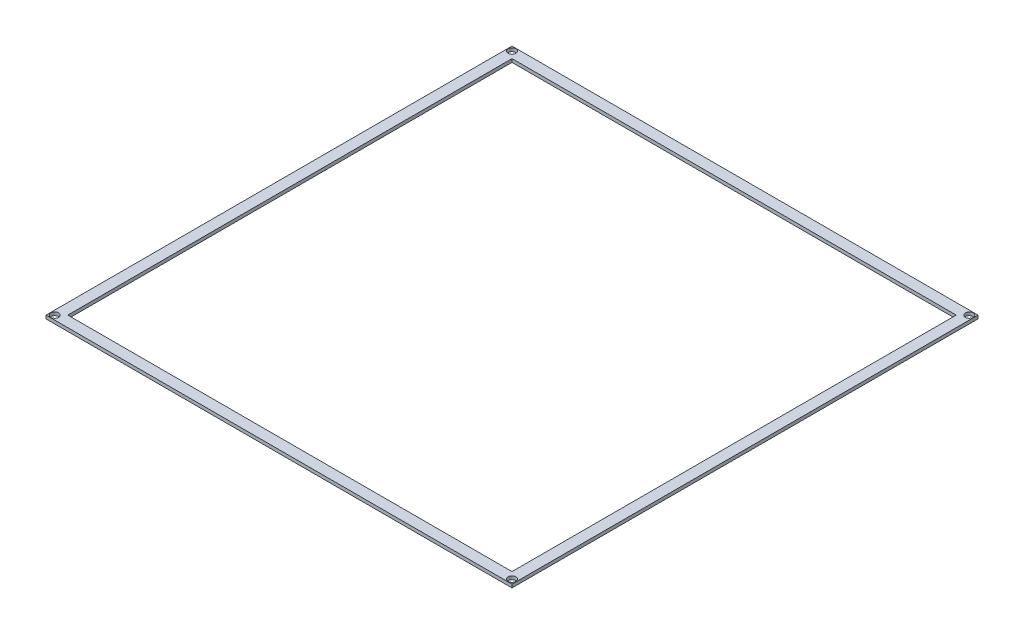
ISO-10303-21;
HEADER;
FILE_DESCRIPTION(('STEP AP214'),'2;1');
FILE_NAME('part.step','',(''),(''),'','','');
FILE_SCHEMA(('AUTOMOTIVE_DESIGN { 1 0 10303 214 1 1 1 1 }'));
ENDSEC;
DATA;
#1=APPLICATION_CONTEXT('core data for automotive mechanical design processes');
#2=APPLICATION_PROTOCOL_DEFINITION('international standard','automotive_design',2000,#1);
#3=PRODUCT_CONTEXT('',#1,'mechanical');
#4=PRODUCT('Part','Part','',(#3));
#5=PRODUCT_RELATED_PRODUCT_CATEGORY('part','',(#4));
#6=PRODUCT_DEFINITION_FORMATION('','',#4);
#7=PRODUCT_DEFINITION_CONTEXT('part definition',#1,'design');
#8=PRODUCT_DEFINITION('design','',#6,#7);
#9=PRODUCT_DEFINITION_SHAPE('','',#8);
#10=(LENGTH_UNIT() NAMED_UNIT(*) SI_UNIT(.MILLI.,.METRE.));
#11=(NAMED_UNIT(*) PLANE_ANGLE_UNIT() SI_UNIT($,.RADIAN.));
#12=(NAMED_UNIT(*) SI_UNIT($,.STERADIAN.) SOLID_ANGLE_UNIT());
#13=UNCERTAINTY_MEASURE_WITH_UNIT(LENGTH_MEASURE(1.E-05),#10,'distance_accuracy_value','');
#14=(GEOMETRIC_REPRESENTATION_CONTEXT(3) GLOBAL_UNCERTAINTY_ASSIGNED_CONTEXT((#13)) GLOBAL_UNIT_ASSIGNED_CONTEXT((#10,
#11,#12)) REPRESENTATION_CONTEXT('',''));
#15=CARTESIAN_POINT('',(0.,0.,0.));
#16=DIRECTION('',(0.,0.,1.));
#17=DIRECTION('',(1.,0.,0.));
#18=AXIS2_PLACEMENT_3D('',#15,#16,#17);
#19=CARTESIAN_POINT('',(0.,1.51892,0.));
#20=DIRECTION('',(0.,-1.,0.));
#21=DIRECTION('',(0.,0.,-1.));
#22=AXIS2_PLACEMENT_3D('',#19,#20,#21);
#23=PLANE('',#22);
#24=CARTESIAN_POINT('',(-105.,1.51892,-105.));
#25=DIRECTION('',(0.,1.,0.));
#26=DIRECTION('',(0.,0.,1.));
#27=AXIS2_PLACEMENT_3D('',#24,#25,#26);
#28=CIRCLE('',#27,1.8);
#29=CARTESIAN_POINT('',(-105.,1.51892,-103.2));
#30=VERTEX_POINT('',#29);
#31=EDGE_CURVE('E253',#30,#30,#28,.T.);
#32=ORIENTED_EDGE('',*,*,#31,.F.);
#33=EDGE_LOOP('',(#32));
#34=FACE_BOUND('',#33,.T.);
#35=CARTESIAN_POINT('',(105.,1.51892,-105.));
#36=DIRECTION('',(0.,1.,0.));
#37=DIRECTION('',(0.,0.,1.));
#38=AXIS2_PLACEMENT_3D('',#35,#36,#37);
#39=CIRCLE('',#38,1.8);
#40=CARTESIAN_POINT('',(105.,1.51892,-103.2));
#41=VERTEX_POINT('',#40);
#42=EDGE_CURVE('E247',#41,#41,#39,.T.);
#43=ORIENTED_EDGE('',*,*,#42,.F.);
#44=EDGE_LOOP('',(#43));
#45=FACE_BOUND('',#44,.T.);
#46=CARTESIAN_POINT('',(105.,1.51892,105.));
#47=DIRECTION('',(0.,1.,0.));
#48=DIRECTION('',(0.,0.,1.));
#49=AXIS2_PLACEMENT_3D('',#46,#47,#48);
#50=CIRCLE('',#49,1.8);
#51=CARTESIAN_POINT('',(105.,1.51892,106.8));
#52=VERTEX_POINT('',#51);
#53=EDGE_CURVE('E239',#52,#52,#50,.T.);
#54=ORIENTED_EDGE('',*,*,#53,.F.);
#55=EDGE_LOOP('',(#54));
#56=FACE_BOUND('',#55,.T.);
#57=DIRECTION('',(-1.,0.,0.));
#58=VECTOR('',#57,1.);
#59=CARTESIAN_POINT('',(-102.,1.51892,-102.));
#60=LINE('',#59,#58);
#61=CARTESIAN_POINT('',(102.,1.51892,-102.));
#62=VERTEX_POINT('',#61);
#63=CARTESIAN_POINT('',(-102.,1.51892,-102.));
#64=VERTEX_POINT('',#63);
#65=EDGE_CURVE('E130',#62,#64,#60,.T.);
#66=ORIENTED_EDGE('',*,*,#65,.F.);
#67=DIRECTION('',(0.,0.,-1.));
#68=VECTOR('',#67,1.);
#69=CARTESIAN_POINT('',(102.,1.51892,102.));
#70=LINE('',#69,#68);
#71=CARTESIAN_POINT('',(102.,1.51892,102.));
#72=VERTEX_POINT('',#71);
#73=EDGE_CURVE('E50',#72,#62,#70,.T.);
#74=ORIENTED_EDGE('',*,*,#73,.F.);
#75=DIRECTION('',(1.,0.,0.));
#76=VECTOR('',#75,1.);
#77=CARTESIAN_POINT('',(-102.,1.51892,102.));
#78=LINE('',#77,#76);
#79=CARTESIAN_POINT('',(-102.,1.51892,102.));
#80=VERTEX_POINT('',#79);
#81=EDGE_CURVE('E118',#80,#72,#78,.T.);
#82=ORIENTED_EDGE('',*,*,#81,.F.);
#83=DIRECTION('',(0.,0.,1.));
#84=VECTOR('',#83,1.);
#85=CARTESIAN_POINT('',(-102.,1.51892,102.));
#86=LINE('',#85,#84);
#87=EDGE_CURVE('E121',#64,#80,#86,.T.);
#88=ORIENTED_EDGE('',*,*,#87,.F.);
#89=EDGE_LOOP('',(#66,#74,#82,#88));
#90=FACE_BOUND('',#89,.T.);
#91=DIRECTION('',(0.,0.,1.));
#92=VECTOR('',#91,1.);
#93=CARTESIAN_POINT('',(-107.,1.51892,-107.));
#94=LINE('',#93,#92);
#95=CARTESIAN_POINT('',(-107.,1.51892,-107.));
#96=VERTEX_POINT('',#95);
#97=CARTESIAN_POINT('',(-107.,1.51892,107.));
#98=VERTEX_POINT('',#97);
#99=EDGE_CURVE('E140',#96,#98,#94,.T.);
#100=ORIENTED_EDGE('',*,*,#99,.T.);
#101=DIRECTION('',(1.,0.,0.));
#102=VECTOR('',#101,1.);
#103=CARTESIAN_POINT('',(107.,1.51892,107.));
#104=LINE('',#103,#102);
#105=CARTESIAN_POINT('',(107.,1.51892,107.));
#106=VERTEX_POINT('',#105);
#107=EDGE_CURVE('E143',#98,#106,#104,.T.);
#108=ORIENTED_EDGE('',*,*,#107,.T.);
#109=DIRECTION('',(0.,0.,-1.));
#110=VECTOR('',#109,1.);
#111=CARTESIAN_POINT('',(107.,1.51892,-107.));
#112=LINE('',#111,#110);
#113=CARTESIAN_POINT('',(107.,1.51892,-107.));
#114=VERTEX_POINT('',#113);
#115=EDGE_CURVE('E146',#106,#114,#112,.T.);
#116=ORIENTED_EDGE('',*,*,#115,.T.);
#117=DIRECTION('',(-1.,0.,0.));
#118=VECTOR('',#117,1.);
#119=CARTESIAN_POINT('',(107.,1.51892,-107.));
#120=LINE('',#119,#118);
#121=EDGE_CURVE('E148',#114,#96,#120,.T.);
#122=ORIENTED_EDGE('',*,*,#121,.T.);
#123=EDGE_LOOP('',(#100,#108,#116,#122));
#124=FACE_BOUND('',#123,.T.);
#125=CARTESIAN_POINT('',(-105.,1.51892,105.));
#126=DIRECTION('',(0.,1.,0.));
#127=DIRECTION('',(0.,0.,1.));
#128=AXIS2_PLACEMENT_3D('',#125,#126,#127);
#129=CIRCLE('',#128,1.8);
#130=CARTESIAN_POINT('',(-105.,1.51892,106.8));
#131=VERTEX_POINT('',#130);
#132=EDGE_CURVE('E236',#131,#131,#129,.T.);
#133=ORIENTED_EDGE('',*,*,#132,.F.);
#134=EDGE_LOOP('',(#133));
#135=FACE_BOUND('',#134,.T.);
#136=ADVANCED_FACE('F35',(#34,#45,#56,#90,#124,#135),#23,.F.);
#137=CARTESIAN_POINT('',(0.,0.,0.));
#138=DIRECTION('',(0.,-1.,0.));
#139=DIRECTION('',(0.,0.,-1.));
#140=AXIS2_PLACEMENT_3D('',#137,#138,#139);
#141=PLANE('',#140);
#142=CARTESIAN_POINT('',(-105.,0.,-105.));
#143=DIRECTION('',(0.,1.,0.));
#144=DIRECTION('',(0.,0.,1.));
#145=AXIS2_PLACEMENT_3D('',#142,#143,#144);
#146=CIRCLE('',#145,1.8);
#147=CARTESIAN_POINT('',(-105.,0.,-103.2));
#148=VERTEX_POINT('',#147);
#149=EDGE_CURVE('E250',#148,#148,#146,.T.);
#150=ORIENTED_EDGE('',*,*,#149,.T.);
#151=EDGE_LOOP('',(#150));
#152=FACE_BOUND('',#151,.T.);
#153=CARTESIAN_POINT('',(105.,0.,-105.));
#154=DIRECTION('',(0.,1.,0.));
#155=DIRECTION('',(0.,0.,1.));
#156=AXIS2_PLACEMENT_3D('',#153,#154,#155);
#157=CIRCLE('',#156,1.8);
#158=CARTESIAN_POINT('',(105.,0.,-103.2));
#159=VERTEX_POINT('',#158);
#160=EDGE_CURVE('E244',#159,#159,#157,.T.);
#161=ORIENTED_EDGE('',*,*,#160,.T.);
#162=EDGE_LOOP('',(#161));
#163=FACE_BOUND('',#162,.T.);
#164=CARTESIAN_POINT('',(105.,0.,105.));
#165=DIRECTION('',(0.,1.,0.));
#166=DIRECTION('',(0.,0.,1.));
#167=AXIS2_PLACEMENT_3D('',#164,#165,#166);
#168=CIRCLE('',#167,1.8);
#169=CARTESIAN_POINT('',(105.,0.,106.8));
#170=VERTEX_POINT('',#169);
#171=EDGE_CURVE('E237',#170,#170,#168,.T.);
#172=ORIENTED_EDGE('',*,*,#171,.T.);
#173=EDGE_LOOP('',(#172));
#174=FACE_BOUND('',#173,.T.);
#175=DIRECTION('',(0.,0.,1.));
#176=VECTOR('',#175,1.);
#177=CARTESIAN_POINT('',(-107.,0.,-107.));
#178=LINE('',#177,#176);
#179=CARTESIAN_POINT('',(-107.,0.,-107.));
#180=VERTEX_POINT('',#179);
#181=CARTESIAN_POINT('',(-107.,0.,107.));
#182=VERTEX_POINT('',#181);
#183=EDGE_CURVE('E136',#180,#182,#178,.T.);
#184=ORIENTED_EDGE('',*,*,#183,.F.);
#185=DIRECTION('',(-1.,0.,0.));
#186=VECTOR('',#185,1.);
#187=CARTESIAN_POINT('',(107.,0.,-107.));
#188=LINE('',#187,#186);
#189=CARTESIAN_POINT('',(107.,0.,-107.));
#190=VERTEX_POINT('',#189);
#191=EDGE_CURVE('E144',#190,#180,#188,.T.);
#192=ORIENTED_EDGE('',*,*,#191,.F.);
#193=DIRECTION('',(0.,0.,-1.));
#194=VECTOR('',#193,1.);
#195=CARTESIAN_POINT('',(107.,0.,-107.));
#196=LINE('',#195,#194);
#197=CARTESIAN_POINT('',(107.,0.,107.));
#198=VERTEX_POINT('',#197);
#199=EDGE_CURVE('E155',#198,#190,#196,.T.);
#200=ORIENTED_EDGE('',*,*,#199,.F.);
#201=DIRECTION('',(1.,0.,0.));
#202=VECTOR('',#201,1.);
#203=CARTESIAN_POINT('',(107.,0.,107.));
#204=LINE('',#203,#202);
#205=EDGE_CURVE('E153',#182,#198,#204,.T.);
#206=ORIENTED_EDGE('',*,*,#205,.F.);
#207=EDGE_LOOP('',(#184,#192,#200,#206));
#208=FACE_BOUND('',#207,.T.);
#209=DIRECTION('',(0.,0.,-1.));
#210=VECTOR('',#209,1.);
#211=CARTESIAN_POINT('',(102.,0.,102.));
#212=LINE('',#211,#210);
#213=CARTESIAN_POINT('',(102.,0.,102.));
#214=VERTEX_POINT('',#213);
#215=CARTESIAN_POINT('',(102.,0.,-102.));
#216=VERTEX_POINT('',#215);
#217=EDGE_CURVE('E102',#214,#216,#212,.T.);
#218=ORIENTED_EDGE('',*,*,#217,.T.);
#219=DIRECTION('',(-1.,0.,0.));
#220=VECTOR('',#219,1.);
#221=CARTESIAN_POINT('',(-102.,0.,-102.));
#222=LINE('',#221,#220);
#223=CARTESIAN_POINT('',(-102.,0.,-102.));
#224=VERTEX_POINT('',#223);
#225=EDGE_CURVE('E111',#216,#224,#222,.T.);
#226=ORIENTED_EDGE('',*,*,#225,.T.);
#227=DIRECTION('',(0.,0.,1.));
#228=VECTOR('',#227,1.);
#229=CARTESIAN_POINT('',(-102.,0.,102.));
#230=LINE('',#229,#228);
#231=CARTESIAN_POINT('',(-102.,0.,102.));
#232=VERTEX_POINT('',#231);
#233=EDGE_CURVE('E58',#224,#232,#230,.T.);
#234=ORIENTED_EDGE('',*,*,#233,.T.);
#235=DIRECTION('',(1.,0.,0.));
#236=VECTOR('',#235,1.);
#237=CARTESIAN_POINT('',(-102.,0.,102.));
#238=LINE('',#237,#236);
#239=EDGE_CURVE('E108',#232,#214,#238,.T.);
#240=ORIENTED_EDGE('',*,*,#239,.T.);
#241=EDGE_LOOP('',(#218,#226,#234,#240));
#242=FACE_BOUND('',#241,.T.);
#243=CARTESIAN_POINT('',(-105.,0.,105.));
#244=DIRECTION('',(0.,1.,0.));
#245=DIRECTION('',(0.,0.,1.));
#246=AXIS2_PLACEMENT_3D('',#243,#244,#245);
#247=CIRCLE('',#246,1.8);
#248=CARTESIAN_POINT('',(-105.,0.,106.8));
#249=VERTEX_POINT('',#248);
#250=EDGE_CURVE('E124',#249,#249,#247,.T.);
#251=ORIENTED_EDGE('',*,*,#250,.T.);
#252=EDGE_LOOP('',(#251));
#253=FACE_BOUND('',#252,.T.);
#254=ADVANCED_FACE('F115',(#152,#163,#174,#208,#242,#253),#141,.T.);
#255=CARTESIAN_POINT('',(-107.,1.51892,-107.));
#256=DIRECTION('',(1.,0.,0.));
#257=DIRECTION('',(0.,0.,-1.));
#258=AXIS2_PLACEMENT_3D('',#255,#256,#257);
#259=PLANE('',#258);
#260=ORIENTED_EDGE('',*,*,#183,.T.);
#261=DIRECTION('',(0.,-1.,0.));
#262=VECTOR('',#261,1.);
#263=CARTESIAN_POINT('',(-107.,1.51892,107.));
#264=LINE('',#263,#262);
#265=EDGE_CURVE('E11',#98,#182,#264,.T.);
#266=ORIENTED_EDGE('',*,*,#265,.F.);
#267=ORIENTED_EDGE('',*,*,#99,.F.);
#268=DIRECTION('',(0.,-1.,0.));
#269=VECTOR('',#268,1.);
#270=CARTESIAN_POINT('',(-107.,1.51892,-107.));
#271=LINE('',#270,#269);
#272=EDGE_CURVE('E150',#96,#180,#271,.T.);
#273=ORIENTED_EDGE('',*,*,#272,.T.);
#274=EDGE_LOOP('',(#260,#266,#267,#273));
#275=FACE_BOUND('',#274,.T.);
#276=ADVANCED_FACE('F37',(#275),#259,.F.);
#277=CARTESIAN_POINT('',(107.,1.51892,107.));
#278=DIRECTION('',(0.,0.,-1.));
#279=DIRECTION('',(-1.,0.,0.));
#280=AXIS2_PLACEMENT_3D('',#277,#278,#279);
#281=PLANE('',#280);
#282=ORIENTED_EDGE('',*,*,#205,.T.);
#283=DIRECTION('',(0.,-1.,0.));
#284=VECTOR('',#283,1.);
#285=CARTESIAN_POINT('',(107.,1.51892,107.));
#286=LINE('',#285,#284);
#287=EDGE_CURVE('E43',#106,#198,#286,.T.);
#288=ORIENTED_EDGE('',*,*,#287,.F.);
#289=ORIENTED_EDGE('',*,*,#107,.F.);
#290=ORIENTED_EDGE('',*,*,#265,.T.);
#291=EDGE_LOOP('',(#282,#288,#289,#290));
#292=FACE_BOUND('',#291,.T.);
#293=ADVANCED_FACE('F182',(#292),#281,.F.);
#294=CARTESIAN_POINT('',(107.,1.51892,-107.));
#295=DIRECTION('',(-1.,0.,0.));
#296=DIRECTION('',(0.,0.,1.));
#297=AXIS2_PLACEMENT_3D('',#294,#295,#296);
#298=PLANE('',#297);
#299=ORIENTED_EDGE('',*,*,#199,.T.);
#300=DIRECTION('',(0.,-1.,0.));
#301=VECTOR('',#300,1.);
#302=CARTESIAN_POINT('',(107.,1.51892,-107.));
#303=LINE('',#302,#301);
#304=EDGE_CURVE('E160',#114,#190,#303,.T.);
#305=ORIENTED_EDGE('',*,*,#304,.F.);
#306=ORIENTED_EDGE('',*,*,#115,.F.);
#307=ORIENTED_EDGE('',*,*,#287,.T.);
#308=EDGE_LOOP('',(#299,#305,#306,#307));
#309=FACE_BOUND('',#308,.T.);
#310=ADVANCED_FACE('F167',(#309),#298,.F.);
#311=CARTESIAN_POINT('',(107.,1.51892,-107.));
#312=DIRECTION('',(0.,0.,1.));
#313=DIRECTION('',(1.,0.,0.));
#314=AXIS2_PLACEMENT_3D('',#311,#312,#313);
#315=PLANE('',#314);
#316=ORIENTED_EDGE('',*,*,#191,.T.);
#317=ORIENTED_EDGE('',*,*,#272,.F.);
#318=ORIENTED_EDGE('',*,*,#121,.F.);
#319=ORIENTED_EDGE('',*,*,#304,.T.);
#320=EDGE_LOOP('',(#316,#317,#318,#319));
#321=FACE_BOUND('',#320,.T.);
#322=ADVANCED_FACE('F175',(#321),#315,.F.);
#323=CARTESIAN_POINT('',(102.,0.,102.));
#324=DIRECTION('',(1.,0.,0.));
#325=DIRECTION('',(0.,0.,-1.));
#326=AXIS2_PLACEMENT_3D('',#323,#324,#325);
#327=PLANE('',#326);
#328=ORIENTED_EDGE('',*,*,#73,.T.);
#329=DIRECTION('',(0.,1.,0.));
#330=VECTOR('',#329,1.);
#331=CARTESIAN_POINT('',(102.,0.,-102.));
#332=LINE('',#331,#330);
#333=EDGE_CURVE('E98',#216,#62,#332,.T.);
#334=ORIENTED_EDGE('',*,*,#333,.F.);
#335=ORIENTED_EDGE('',*,*,#217,.F.);
#336=DIRECTION('',(0.,1.,0.));
#337=VECTOR('',#336,1.);
#338=CARTESIAN_POINT('',(102.,0.,102.));
#339=LINE('',#338,#337);
#340=EDGE_CURVE('E134',#214,#72,#339,.T.);
#341=ORIENTED_EDGE('',*,*,#340,.T.);
#342=EDGE_LOOP('',(#328,#334,#335,#341));
#343=FACE_BOUND('',#342,.T.);
#344=ADVANCED_FACE('F100',(#343),#327,.F.);
#345=CARTESIAN_POINT('',(-102.,0.,102.));
#346=DIRECTION('',(0.,0.,1.));
#347=DIRECTION('',(1.,0.,0.));
#348=AXIS2_PLACEMENT_3D('',#345,#346,#347);
#349=PLANE('',#348);
#350=ORIENTED_EDGE('',*,*,#81,.T.);
#351=ORIENTED_EDGE('',*,*,#340,.F.);
#352=ORIENTED_EDGE('',*,*,#239,.F.);
#353=DIRECTION('',(0.,1.,0.));
#354=VECTOR('',#353,1.);
#355=CARTESIAN_POINT('',(-102.,0.,102.));
#356=LINE('',#355,#354);
#357=EDGE_CURVE('E137',#232,#80,#356,.T.);
#358=ORIENTED_EDGE('',*,*,#357,.T.);
#359=EDGE_LOOP('',(#350,#351,#352,#358));
#360=FACE_BOUND('',#359,.T.);
#361=ADVANCED_FACE('F206',(#360),#349,.F.);
#362=CARTESIAN_POINT('',(-102.,0.,102.));
#363=DIRECTION('',(-1.,0.,0.));
#364=DIRECTION('',(0.,0.,1.));
#365=AXIS2_PLACEMENT_3D('',#362,#363,#364);
#366=PLANE('',#365);
#367=ORIENTED_EDGE('',*,*,#87,.T.);
#368=ORIENTED_EDGE('',*,*,#357,.F.);
#369=ORIENTED_EDGE('',*,*,#233,.F.);
#370=DIRECTION('',(0.,1.,0.));
#371=VECTOR('',#370,1.);
#372=CARTESIAN_POINT('',(-102.,0.,-102.));
#373=LINE('',#372,#371);
#374=EDGE_CURVE('E107',#224,#64,#373,.T.);
#375=ORIENTED_EDGE('',*,*,#374,.T.);
#376=EDGE_LOOP('',(#367,#368,#369,#375));
#377=FACE_BOUND('',#376,.T.);
#378=ADVANCED_FACE('F210',(#377),#366,.F.);
#379=CARTESIAN_POINT('',(-102.,0.,-102.));
#380=DIRECTION('',(0.,0.,-1.));
#381=DIRECTION('',(-1.,0.,0.));
#382=AXIS2_PLACEMENT_3D('',#379,#380,#381);
#383=PLANE('',#382);
#384=ORIENTED_EDGE('',*,*,#65,.T.);
#385=ORIENTED_EDGE('',*,*,#374,.F.);
#386=ORIENTED_EDGE('',*,*,#225,.F.);
#387=ORIENTED_EDGE('',*,*,#333,.T.);
#388=EDGE_LOOP('',(#384,#385,#386,#387));
#389=FACE_BOUND('',#388,.T.);
#390=ADVANCED_FACE('F112',(#389),#383,.F.);
#391=CARTESIAN_POINT('',(-105.,1.51892,105.));
#392=DIRECTION('',(0.,1.,0.));
#393=DIRECTION('',(0.,0.,1.));
#394=AXIS2_PLACEMENT_3D('',#391,#392,#393);
#395=CYLINDRICAL_SURFACE('',#394,1.8);
#396=ORIENTED_EDGE('',*,*,#250,.F.);
#397=EDGE_LOOP('',(#396));
#398=FACE_BOUND('',#397,.T.);
#399=ORIENTED_EDGE('',*,*,#132,.T.);
#400=EDGE_LOOP('',(#399));
#401=FACE_BOUND('',#400,.T.);
#402=ADVANCED_FACE('F218',(#398,#401),#395,.F.);
#403=CARTESIAN_POINT('',(105.,1.51892,105.));
#404=DIRECTION('',(0.,1.,0.));
#405=DIRECTION('',(0.,0.,1.));
#406=AXIS2_PLACEMENT_3D('',#403,#404,#405);
#407=CYLINDRICAL_SURFACE('',#406,1.8);
#408=ORIENTED_EDGE('',*,*,#171,.F.);
#409=EDGE_LOOP('',(#408));
#410=FACE_BOUND('',#409,.T.);
#411=ORIENTED_EDGE('',*,*,#53,.T.);
#412=EDGE_LOOP('',(#411));
#413=FACE_BOUND('',#412,.T.);
#414=ADVANCED_FACE('F224',(#410,#413),#407,.F.);
#415=CARTESIAN_POINT('',(105.,1.51892,-105.));
#416=DIRECTION('',(0.,1.,0.));
#417=DIRECTION('',(0.,0.,1.));
#418=AXIS2_PLACEMENT_3D('',#415,#416,#417);
#419=CYLINDRICAL_SURFACE('',#418,1.8);
#420=ORIENTED_EDGE('',*,*,#160,.F.);
#421=EDGE_LOOP('',(#420));
#422=FACE_BOUND('',#421,.T.);
#423=ORIENTED_EDGE('',*,*,#42,.T.);
#424=EDGE_LOOP('',(#423));
#425=FACE_BOUND('',#424,.T.);
#426=ADVANCED_FACE('F229',(#422,#425),#419,.F.);
#427=CARTESIAN_POINT('',(-105.,1.51892,-105.));
#428=DIRECTION('',(0.,1.,0.));
#429=DIRECTION('',(0.,0.,1.));
#430=AXIS2_PLACEMENT_3D('',#427,#428,#429);
#431=CYLINDRICAL_SURFACE('',#430,1.8);
#432=ORIENTED_EDGE('',*,*,#149,.F.);
#433=EDGE_LOOP('',(#432));
#434=FACE_BOUND('',#433,.T.);
#435=ORIENTED_EDGE('',*,*,#31,.T.);
#436=EDGE_LOOP('',(#435));
#437=FACE_BOUND('',#436,.T.);
#438=ADVANCED_FACE('F256',(#434,#437),#431,.F.);
#439=CLOSED_SHELL('',(#136,#254,#276,#293,#310,#322,#344,#361,#378,#390,#402,#414,#426,#438));
#440=MANIFOLD_SOLID_BREP('B2',#439);
#441=ADVANCED_BREP_SHAPE_REPRESENTATION('',(#18,#440),#14);
#442=SHAPE_DEFINITION_REPRESENTATION(#9,#441);
ENDSEC;
END-ISO-10303-21;
